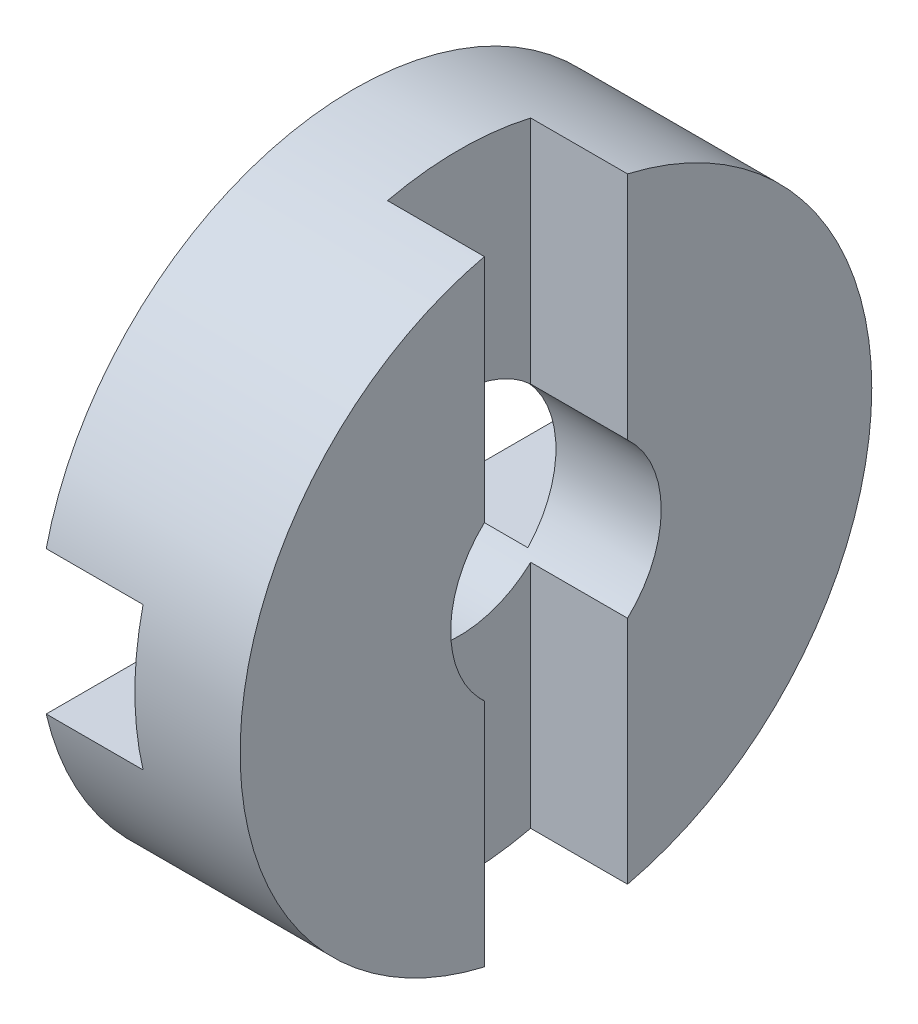
ISO-10303-21;
HEADER;
FILE_DESCRIPTION(('STEP AP214'),'2;1');
FILE_NAME('part.step','',(''),(''),'','','');
FILE_SCHEMA(('AUTOMOTIVE_DESIGN { 1 0 10303 214 1 1 1 1 }'));
ENDSEC;
DATA;
#1=APPLICATION_CONTEXT('core data for automotive mechanical design processes');
#2=APPLICATION_PROTOCOL_DEFINITION('international standard','automotive_design',2000,#1);
#3=PRODUCT_CONTEXT('',#1,'mechanical');
#4=PRODUCT('Part','Part','',(#3));
#5=PRODUCT_RELATED_PRODUCT_CATEGORY('part','',(#4));
#6=PRODUCT_DEFINITION_FORMATION('','',#4);
#7=PRODUCT_DEFINITION_CONTEXT('part definition',#1,'design');
#8=PRODUCT_DEFINITION('design','',#6,#7);
#9=PRODUCT_DEFINITION_SHAPE('','',#8);
#10=(LENGTH_UNIT() NAMED_UNIT(*) SI_UNIT(.MILLI.,.METRE.));
#11=(NAMED_UNIT(*) PLANE_ANGLE_UNIT() SI_UNIT($,.RADIAN.));
#12=(NAMED_UNIT(*) SI_UNIT($,.STERADIAN.) SOLID_ANGLE_UNIT());
#13=UNCERTAINTY_MEASURE_WITH_UNIT(LENGTH_MEASURE(1.E-05),#10,'distance_accuracy_value','');
#14=(GEOMETRIC_REPRESENTATION_CONTEXT(3) GLOBAL_UNCERTAINTY_ASSIGNED_CONTEXT((#13)) GLOBAL_UNIT_ASSIGNED_CONTEXT((#10,
#11,#12)) REPRESENTATION_CONTEXT('',''));
#15=CARTESIAN_POINT('',(0.,0.,0.));
#16=DIRECTION('',(0.,0.,1.));
#17=DIRECTION('',(1.,0.,0.));
#18=AXIS2_PLACEMENT_3D('',#15,#16,#17);
#19=CARTESIAN_POINT('',(-0.1,1.7,-7.5));
#20=DIRECTION('',(1.,0.,0.));
#21=DIRECTION('',(0.,0.,-1.));
#22=AXIS2_PLACEMENT_3D('',#19,#20,#21);
#23=PLANE('',#22);
#24=DIRECTION('',(0.,0.,1.));
#25=VECTOR('',#24,1.);
#26=CARTESIAN_POINT('',(-0.0999999999999998,1.7,-7.5));
#27=LINE('',#26,#25);
#28=CARTESIAN_POINT('',(-0.0999999999999999,1.7,-1.83303027798234));
#29=VERTEX_POINT('',#28);
#30=CARTESIAN_POINT('',(-0.1,1.7,-7.30479294709987));
#31=VERTEX_POINT('',#30);
#32=EDGE_CURVE('E141',#29,#31,#27,.F.);
#33=ORIENTED_EDGE('',*,*,#32,.T.);
#34=CARTESIAN_POINT('',(-0.1,0.,0.));
#35=DIRECTION('',(-1.,0.,0.));
#36=DIRECTION('',(0.,0.,1.));
#37=AXIS2_PLACEMENT_3D('',#34,#35,#36);
#38=CIRCLE('',#37,7.5);
#39=CARTESIAN_POINT('',(-0.1,-1.7,-7.30479294709987));
#40=VERTEX_POINT('',#39);
#41=EDGE_CURVE('E20',#40,#31,#38,.F.);
#42=ORIENTED_EDGE('',*,*,#41,.F.);
#43=DIRECTION('',(0.,0.,-1.));
#44=VECTOR('',#43,1.);
#45=CARTESIAN_POINT('',(-0.1,-1.7,-7.5));
#46=LINE('',#45,#44);
#47=CARTESIAN_POINT('',(-0.1,-1.7,-1.83303027798234));
#48=VERTEX_POINT('',#47);
#49=EDGE_CURVE('E205',#40,#48,#46,.F.);
#50=ORIENTED_EDGE('',*,*,#49,.T.);
#51=CARTESIAN_POINT('',(-0.1,0.,0.));
#52=DIRECTION('',(-1.,0.,0.));
#53=DIRECTION('',(0.,0.,1.));
#54=AXIS2_PLACEMENT_3D('',#51,#52,#53);
#55=CIRCLE('',#54,2.5);
#56=EDGE_CURVE('E143',#48,#29,#55,.F.);
#57=ORIENTED_EDGE('',*,*,#56,.T.);
#58=EDGE_LOOP('',(#33,#42,#50,#57));
#59=FACE_BOUND('',#58,.T.);
#60=ADVANCED_FACE('F17',(#59),#23,.F.);
#61=CARTESIAN_POINT('',(-0.1,1.7,-7.5));
#62=DIRECTION('',(1.,0.,0.));
#63=DIRECTION('',(0.,0.,-1.));
#64=AXIS2_PLACEMENT_3D('',#61,#62,#63);
#65=PLANE('',#64);
#66=DIRECTION('',(0.,0.,1.));
#67=VECTOR('',#66,1.);
#68=CARTESIAN_POINT('',(-0.0999999999999998,1.7,-7.5));
#69=LINE('',#68,#67);
#70=CARTESIAN_POINT('',(-0.0999999999999999,1.7,7.30479294709987));
#71=VERTEX_POINT('',#70);
#72=CARTESIAN_POINT('',(-0.0999999999999999,1.7,1.83303027798234));
#73=VERTEX_POINT('',#72);
#74=EDGE_CURVE('E212',#71,#73,#69,.F.);
#75=ORIENTED_EDGE('',*,*,#74,.T.);
#76=CARTESIAN_POINT('',(-0.1,0.,0.));
#77=DIRECTION('',(-1.,0.,0.));
#78=DIRECTION('',(0.,0.,1.));
#79=AXIS2_PLACEMENT_3D('',#76,#77,#78);
#80=CIRCLE('',#79,2.5);
#81=CARTESIAN_POINT('',(-0.1,-1.7,1.83303027798234));
#82=VERTEX_POINT('',#81);
#83=EDGE_CURVE('E188',#73,#82,#80,.F.);
#84=ORIENTED_EDGE('',*,*,#83,.T.);
#85=DIRECTION('',(0.,0.,-1.));
#86=VECTOR('',#85,1.);
#87=CARTESIAN_POINT('',(-0.1,-1.7,-7.5));
#88=LINE('',#87,#86);
#89=CARTESIAN_POINT('',(-0.1,-1.7,7.30479294709987));
#90=VERTEX_POINT('',#89);
#91=EDGE_CURVE('E198',#82,#90,#88,.F.);
#92=ORIENTED_EDGE('',*,*,#91,.T.);
#93=CARTESIAN_POINT('',(-0.1,0.,0.));
#94=DIRECTION('',(-1.,0.,0.));
#95=DIRECTION('',(0.,0.,1.));
#96=AXIS2_PLACEMENT_3D('',#93,#94,#95);
#97=CIRCLE('',#96,7.5);
#98=EDGE_CURVE('E139',#71,#90,#97,.F.);
#99=ORIENTED_EDGE('',*,*,#98,.F.);
#100=EDGE_LOOP('',(#75,#84,#92,#99));
#101=FACE_BOUND('',#100,.T.);
#102=ADVANCED_FACE('F250',(#101),#65,.F.);
#103=CARTESIAN_POINT('',(0.1,-7.5,1.7));
#104=DIRECTION('',(-1.,0.,0.));
#105=DIRECTION('',(0.,0.,1.));
#106=AXIS2_PLACEMENT_3D('',#103,#104,#105);
#107=PLANE('',#106);
#108=DIRECTION('',(0.,1.,0.));
#109=VECTOR('',#108,1.);
#110=CARTESIAN_POINT('',(0.0999999999999998,-7.5,1.7));
#111=LINE('',#110,#109);
#112=CARTESIAN_POINT('',(0.1,-1.83303027798234,1.7));
#113=VERTEX_POINT('',#112);
#114=CARTESIAN_POINT('',(0.1,-7.30479294709987,1.7));
#115=VERTEX_POINT('',#114);
#116=EDGE_CURVE('E208',#113,#115,#111,.F.);
#117=ORIENTED_EDGE('',*,*,#116,.T.);
#118=CARTESIAN_POINT('',(0.1,0.,0.));
#119=DIRECTION('',(-1.,0.,0.));
#120=DIRECTION('',(0.,0.,1.));
#121=AXIS2_PLACEMENT_3D('',#118,#119,#120);
#122=CIRCLE('',#121,7.5);
#123=CARTESIAN_POINT('',(0.1,-7.30479294709987,-1.7));
#124=VERTEX_POINT('',#123);
#125=EDGE_CURVE('E173',#124,#115,#122,.T.);
#126=ORIENTED_EDGE('',*,*,#125,.F.);
#127=DIRECTION('',(0.,1.,0.));
#128=VECTOR('',#127,1.);
#129=CARTESIAN_POINT('',(0.1,-7.5,-1.7));
#130=LINE('',#129,#128);
#131=CARTESIAN_POINT('',(0.1,-1.83303027798234,-1.7));
#132=VERTEX_POINT('',#131);
#133=EDGE_CURVE('E175',#124,#132,#130,.T.);
#134=ORIENTED_EDGE('',*,*,#133,.T.);
#135=CARTESIAN_POINT('',(0.1,0.,0.));
#136=DIRECTION('',(-1.,0.,0.));
#137=DIRECTION('',(0.,0.,1.));
#138=AXIS2_PLACEMENT_3D('',#135,#136,#137);
#139=CIRCLE('',#138,2.5);
#140=EDGE_CURVE('E189',#132,#113,#139,.T.);
#141=ORIENTED_EDGE('',*,*,#140,.T.);
#142=EDGE_LOOP('',(#117,#126,#134,#141));
#143=FACE_BOUND('',#142,.T.);
#144=ADVANCED_FACE('F332',(#143),#107,.F.);
#145=CARTESIAN_POINT('',(-0.1,-1.7,-7.5));
#146=DIRECTION('',(0.,-1.,0.));
#147=DIRECTION('',(0.,0.,-1.));
#148=AXIS2_PLACEMENT_3D('',#145,#146,#147);
#149=PLANE('',#148);
#150=ORIENTED_EDGE('',*,*,#91,.F.);
#151=DIRECTION('',(-1.,0.,0.));
#152=VECTOR('',#151,1.);
#153=CARTESIAN_POINT('',(0.,-1.7,1.83303027798234));
#154=LINE('',#153,#152);
#155=CARTESIAN_POINT('',(-2.4,-1.7,1.83303027798234));
#156=VERTEX_POINT('',#155);
#157=EDGE_CURVE('E222',#82,#156,#154,.T.);
#158=ORIENTED_EDGE('',*,*,#157,.T.);
#159=DIRECTION('',(0.,0.,1.));
#160=VECTOR('',#159,1.);
#161=CARTESIAN_POINT('',(-2.4,-1.7,-5.));
#162=LINE('',#161,#160);
#163=CARTESIAN_POINT('',(-2.4,-1.7,7.30479294709987));
#164=VERTEX_POINT('',#163);
#165=EDGE_CURVE('E194',#164,#156,#162,.F.);
#166=ORIENTED_EDGE('',*,*,#165,.F.);
#167=DIRECTION('',(-1.,0.,0.));
#168=VECTOR('',#167,1.);
#169=CARTESIAN_POINT('',(0.,-1.7,7.30479294709987));
#170=LINE('',#169,#168);
#171=EDGE_CURVE('E193',#90,#164,#170,.T.);
#172=ORIENTED_EDGE('',*,*,#171,.F.);
#173=EDGE_LOOP('',(#150,#158,#166,#172));
#174=FACE_BOUND('',#173,.T.);
#175=ADVANCED_FACE('F253',(#174),#149,.F.);
#176=CARTESIAN_POINT('',(-2.4,0.,-5.));
#177=DIRECTION('',(-1.,0.,0.));
#178=DIRECTION('',(0.,0.,1.));
#179=AXIS2_PLACEMENT_3D('',#176,#177,#178);
#180=PLANE('',#179);
#181=DIRECTION('',(0.,0.,-1.));
#182=VECTOR('',#181,1.);
#183=CARTESIAN_POINT('',(-2.4,-1.7,-7.5));
#184=LINE('',#183,#182);
#185=CARTESIAN_POINT('',(-2.4,-1.7,-1.83303027798234));
#186=VERTEX_POINT('',#185);
#187=CARTESIAN_POINT('',(-2.4,-1.7,-7.30479294709987));
#188=VERTEX_POINT('',#187);
#189=EDGE_CURVE('E197',#186,#188,#184,.T.);
#190=ORIENTED_EDGE('',*,*,#189,.T.);
#191=CARTESIAN_POINT('',(-2.4,0.,0.));
#192=DIRECTION('',(-1.,0.,0.));
#193=DIRECTION('',(0.,0.,1.));
#194=AXIS2_PLACEMENT_3D('',#191,#192,#193);
#195=CIRCLE('',#194,7.5);
#196=EDGE_CURVE('E201',#164,#188,#195,.F.);
#197=ORIENTED_EDGE('',*,*,#196,.F.);
#198=ORIENTED_EDGE('',*,*,#165,.T.);
#199=CARTESIAN_POINT('',(-2.4,0.,0.));
#200=DIRECTION('',(-1.,0.,0.));
#201=DIRECTION('',(0.,0.,1.));
#202=AXIS2_PLACEMENT_3D('',#199,#200,#201);
#203=CIRCLE('',#202,2.5);
#204=EDGE_CURVE('E220',#156,#186,#203,.F.);
#205=ORIENTED_EDGE('',*,*,#204,.T.);
#206=EDGE_LOOP('',(#190,#197,#198,#205));
#207=FACE_BOUND('',#206,.T.);
#208=ADVANCED_FACE('F257',(#207),#180,.T.);
#209=CARTESIAN_POINT('',(-0.1,-1.7,-7.5));
#210=DIRECTION('',(0.,-1.,0.));
#211=DIRECTION('',(0.,0.,-1.));
#212=AXIS2_PLACEMENT_3D('',#209,#210,#211);
#213=PLANE('',#212);
#214=ORIENTED_EDGE('',*,*,#49,.F.);
#215=DIRECTION('',(-1.,0.,0.));
#216=VECTOR('',#215,1.);
#217=CARTESIAN_POINT('',(0.,-1.7,-7.30479294709987));
#218=LINE('',#217,#216);
#219=EDGE_CURVE('E136',#188,#40,#218,.F.);
#220=ORIENTED_EDGE('',*,*,#219,.F.);
#221=ORIENTED_EDGE('',*,*,#189,.F.);
#222=DIRECTION('',(-1.,0.,0.));
#223=VECTOR('',#222,1.);
#224=CARTESIAN_POINT('',(0.,-1.7,-1.83303027798234));
#225=LINE('',#224,#223);
#226=EDGE_CURVE('E217',#186,#48,#225,.F.);
#227=ORIENTED_EDGE('',*,*,#226,.T.);
#228=EDGE_LOOP('',(#214,#220,#221,#227));
#229=FACE_BOUND('',#228,.T.);
#230=ADVANCED_FACE('F261',(#229),#213,.F.);
#231=CARTESIAN_POINT('',(2.4,-7.5,1.7));
#232=DIRECTION('',(0.,0.,1.));
#233=DIRECTION('',(1.,0.,0.));
#234=AXIS2_PLACEMENT_3D('',#231,#232,#233);
#235=PLANE('',#234);
#236=DIRECTION('',(0.,1.,0.));
#237=VECTOR('',#236,1.);
#238=CARTESIAN_POINT('',(2.4,0.,1.7));
#239=LINE('',#238,#237);
#240=CARTESIAN_POINT('',(2.4,-7.30479294709987,1.7));
#241=VERTEX_POINT('',#240);
#242=CARTESIAN_POINT('',(2.4,-1.83303027798234,1.7));
#243=VERTEX_POINT('',#242);
#244=EDGE_CURVE('E203',#241,#243,#239,.T.);
#245=ORIENTED_EDGE('',*,*,#244,.F.);
#246=DIRECTION('',(-1.,0.,0.));
#247=VECTOR('',#246,1.);
#248=CARTESIAN_POINT('',(0.,-7.30479294709987,1.7));
#249=LINE('',#248,#247);
#250=EDGE_CURVE('E190',#115,#241,#249,.F.);
#251=ORIENTED_EDGE('',*,*,#250,.F.);
#252=ORIENTED_EDGE('',*,*,#116,.F.);
#253=DIRECTION('',(-1.,0.,0.));
#254=VECTOR('',#253,1.);
#255=CARTESIAN_POINT('',(0.,-1.83303027798234,1.7));
#256=LINE('',#255,#254);
#257=EDGE_CURVE('E185',#113,#243,#256,.F.);
#258=ORIENTED_EDGE('',*,*,#257,.T.);
#259=EDGE_LOOP('',(#245,#251,#252,#258));
#260=FACE_BOUND('',#259,.T.);
#261=ADVANCED_FACE('F319',(#260),#235,.F.);
#262=CARTESIAN_POINT('',(0.,0.,0.));
#263=DIRECTION('',(-1.,0.,0.));
#264=DIRECTION('',(0.,0.,1.));
#265=AXIS2_PLACEMENT_3D('',#262,#263,#264);
#266=CYLINDRICAL_SURFACE('',#265,2.5);
#267=ORIENTED_EDGE('',*,*,#83,.F.);
#268=DIRECTION('',(1.,0.,0.));
#269=VECTOR('',#268,1.);
#270=CARTESIAN_POINT('',(-2.4,1.7,1.83303027798234));
#271=LINE('',#270,#269);
#272=CARTESIAN_POINT('',(-2.4,1.7,1.83303027798234));
#273=VERTEX_POINT('',#272);
#274=EDGE_CURVE('E169',#73,#273,#271,.F.);
#275=ORIENTED_EDGE('',*,*,#274,.T.);
#276=CARTESIAN_POINT('',(-2.4,0.,0.));
#277=DIRECTION('',(-1.,0.,0.));
#278=DIRECTION('',(0.,0.,1.));
#279=AXIS2_PLACEMENT_3D('',#276,#277,#278);
#280=CIRCLE('',#279,2.5);
#281=CARTESIAN_POINT('',(-2.4,1.7,-1.83303027798234));
#282=VERTEX_POINT('',#281);
#283=EDGE_CURVE('E215',#282,#273,#280,.F.);
#284=ORIENTED_EDGE('',*,*,#283,.F.);
#285=DIRECTION('',(1.,0.,0.));
#286=VECTOR('',#285,1.);
#287=CARTESIAN_POINT('',(-2.4,1.7,-1.83303027798234));
#288=LINE('',#287,#286);
#289=EDGE_CURVE('E146',#282,#29,#288,.T.);
#290=ORIENTED_EDGE('',*,*,#289,.T.);
#291=ORIENTED_EDGE('',*,*,#56,.F.);
#292=ORIENTED_EDGE('',*,*,#226,.F.);
#293=ORIENTED_EDGE('',*,*,#204,.F.);
#294=ORIENTED_EDGE('',*,*,#157,.F.);
#295=EDGE_LOOP('',(#267,#275,#284,#290,#291,#292,#293,#294));
#296=FACE_BOUND('',#295,.T.);
#297=CARTESIAN_POINT('',(2.4,0.,0.));
#298=DIRECTION('',(-1.,0.,0.));
#299=DIRECTION('',(0.,0.,1.));
#300=AXIS2_PLACEMENT_3D('',#297,#298,#299);
#301=CIRCLE('',#300,2.5);
#302=CARTESIAN_POINT('',(2.4,1.83303027798234,1.7));
#303=VERTEX_POINT('',#302);
#304=EDGE_CURVE('E235',#243,#303,#301,.T.);
#305=ORIENTED_EDGE('',*,*,#304,.F.);
#306=ORIENTED_EDGE('',*,*,#257,.F.);
#307=ORIENTED_EDGE('',*,*,#140,.F.);
#308=DIRECTION('',(-1.,0.,0.));
#309=VECTOR('',#308,1.);
#310=CARTESIAN_POINT('',(0.1,-1.83303027798234,-1.7));
#311=LINE('',#310,#309);
#312=CARTESIAN_POINT('',(2.4,-1.83303027798234,-1.7));
#313=VERTEX_POINT('',#312);
#314=EDGE_CURVE('E147',#132,#313,#311,.F.);
#315=ORIENTED_EDGE('',*,*,#314,.T.);
#316=CARTESIAN_POINT('',(2.4,0.,0.));
#317=DIRECTION('',(-1.,0.,0.));
#318=DIRECTION('',(0.,0.,1.));
#319=AXIS2_PLACEMENT_3D('',#316,#317,#318);
#320=CIRCLE('',#319,2.5);
#321=CARTESIAN_POINT('',(2.4,1.83303027798234,-1.7));
#322=VERTEX_POINT('',#321);
#323=EDGE_CURVE('E159',#322,#313,#320,.T.);
#324=ORIENTED_EDGE('',*,*,#323,.F.);
#325=DIRECTION('',(-1.,0.,0.));
#326=VECTOR('',#325,1.);
#327=CARTESIAN_POINT('',(0.1,1.83303027798234,-1.7));
#328=LINE('',#327,#326);
#329=CARTESIAN_POINT('',(0.1,1.83303027798234,-1.7));
#330=VERTEX_POINT('',#329);
#331=EDGE_CURVE('E176',#322,#330,#328,.T.);
#332=ORIENTED_EDGE('',*,*,#331,.T.);
#333=CARTESIAN_POINT('',(0.1,0.,0.));
#334=DIRECTION('',(-1.,0.,0.));
#335=DIRECTION('',(0.,0.,1.));
#336=AXIS2_PLACEMENT_3D('',#333,#334,#335);
#337=CIRCLE('',#336,2.5);
#338=CARTESIAN_POINT('',(0.1,1.83303027798234,1.7));
#339=VERTEX_POINT('',#338);
#340=EDGE_CURVE('E232',#330,#339,#337,.F.);
#341=ORIENTED_EDGE('',*,*,#340,.T.);
#342=DIRECTION('',(1.,0.,0.));
#343=VECTOR('',#342,1.);
#344=CARTESIAN_POINT('',(2.4,1.83303027798234,1.7));
#345=LINE('',#344,#343);
#346=EDGE_CURVE('E180',#339,#303,#345,.T.);
#347=ORIENTED_EDGE('',*,*,#346,.T.);
#348=EDGE_LOOP('',(#305,#306,#307,#315,#324,#332,#341,#347));
#349=FACE_BOUND('',#348,.T.);
#350=ADVANCED_FACE('F263',(#296,#349),#266,.F.);
#351=CARTESIAN_POINT('',(0.1,-7.5,-1.7));
#352=DIRECTION('',(0.,0.,-1.));
#353=DIRECTION('',(-1.,0.,0.));
#354=AXIS2_PLACEMENT_3D('',#351,#352,#353);
#355=PLANE('',#354);
#356=ORIENTED_EDGE('',*,*,#133,.F.);
#357=DIRECTION('',(-1.,0.,0.));
#358=VECTOR('',#357,1.);
#359=CARTESIAN_POINT('',(0.,-7.30479294709987,-1.70000000000001));
#360=LINE('',#359,#358);
#361=CARTESIAN_POINT('',(2.4,-7.30479294709987,-1.7));
#362=VERTEX_POINT('',#361);
#363=EDGE_CURVE('E168',#362,#124,#360,.T.);
#364=ORIENTED_EDGE('',*,*,#363,.F.);
#365=DIRECTION('',(0.,1.,0.));
#366=VECTOR('',#365,1.);
#367=CARTESIAN_POINT('',(2.4,0.,-1.7));
#368=LINE('',#367,#366);
#369=EDGE_CURVE('E154',#313,#362,#368,.F.);
#370=ORIENTED_EDGE('',*,*,#369,.F.);
#371=ORIENTED_EDGE('',*,*,#314,.F.);
#372=EDGE_LOOP('',(#356,#364,#370,#371));
#373=FACE_BOUND('',#372,.T.);
#374=ADVANCED_FACE('F329',(#373),#355,.F.);
#375=CARTESIAN_POINT('',(-2.4,1.7,-7.5));
#376=DIRECTION('',(0.,1.,0.));
#377=DIRECTION('',(0.,0.,1.));
#378=AXIS2_PLACEMENT_3D('',#375,#376,#377);
#379=PLANE('',#378);
#380=DIRECTION('',(0.,0.,1.));
#381=VECTOR('',#380,1.);
#382=CARTESIAN_POINT('',(-2.4,1.7,-5.));
#383=LINE('',#382,#381);
#384=CARTESIAN_POINT('',(-2.4,1.7,-7.30479294709987));
#385=VERTEX_POINT('',#384);
#386=EDGE_CURVE('E151',#385,#282,#383,.T.);
#387=ORIENTED_EDGE('',*,*,#386,.F.);
#388=DIRECTION('',(-1.,0.,0.));
#389=VECTOR('',#388,1.);
#390=CARTESIAN_POINT('',(0.,1.7,-7.30479294709987));
#391=LINE('',#390,#389);
#392=EDGE_CURVE('E133',#31,#385,#391,.T.);
#393=ORIENTED_EDGE('',*,*,#392,.F.);
#394=ORIENTED_EDGE('',*,*,#32,.F.);
#395=ORIENTED_EDGE('',*,*,#289,.F.);
#396=EDGE_LOOP('',(#387,#393,#394,#395));
#397=FACE_BOUND('',#396,.T.);
#398=ADVANCED_FACE('F149',(#397),#379,.F.);
#399=CARTESIAN_POINT('',(-2.4,0.,-5.));
#400=DIRECTION('',(-1.,0.,0.));
#401=DIRECTION('',(0.,0.,1.));
#402=AXIS2_PLACEMENT_3D('',#399,#400,#401);
#403=PLANE('',#402);
#404=ORIENTED_EDGE('',*,*,#386,.T.);
#405=ORIENTED_EDGE('',*,*,#283,.T.);
#406=DIRECTION('',(0.,0.,1.));
#407=VECTOR('',#406,1.);
#408=CARTESIAN_POINT('',(-2.4,1.7,-7.5));
#409=LINE('',#408,#407);
#410=CARTESIAN_POINT('',(-2.4,1.7,7.30479294709987));
#411=VERTEX_POINT('',#410);
#412=EDGE_CURVE('E167',#273,#411,#409,.T.);
#413=ORIENTED_EDGE('',*,*,#412,.T.);
#414=CARTESIAN_POINT('',(-2.4,0.,0.));
#415=DIRECTION('',(-1.,0.,0.));
#416=DIRECTION('',(0.,0.,1.));
#417=AXIS2_PLACEMENT_3D('',#414,#415,#416);
#418=CIRCLE('',#417,7.5);
#419=EDGE_CURVE('E153',#385,#411,#418,.F.);
#420=ORIENTED_EDGE('',*,*,#419,.F.);
#421=EDGE_LOOP('',(#404,#405,#413,#420));
#422=FACE_BOUND('',#421,.T.);
#423=ADVANCED_FACE('F269',(#422),#403,.T.);
#424=CARTESIAN_POINT('',(-2.4,1.7,-7.5));
#425=DIRECTION('',(0.,1.,0.));
#426=DIRECTION('',(0.,0.,1.));
#427=AXIS2_PLACEMENT_3D('',#424,#425,#426);
#428=PLANE('',#427);
#429=ORIENTED_EDGE('',*,*,#412,.F.);
#430=ORIENTED_EDGE('',*,*,#274,.F.);
#431=ORIENTED_EDGE('',*,*,#74,.F.);
#432=DIRECTION('',(-1.,0.,0.));
#433=VECTOR('',#432,1.);
#434=CARTESIAN_POINT('',(0.,1.7,7.30479294709987));
#435=LINE('',#434,#433);
#436=EDGE_CURVE('E156',#411,#71,#435,.F.);
#437=ORIENTED_EDGE('',*,*,#436,.F.);
#438=EDGE_LOOP('',(#429,#430,#431,#437));
#439=FACE_BOUND('',#438,.T.);
#440=ADVANCED_FACE('F271',(#439),#428,.F.);
#441=CARTESIAN_POINT('',(2.4,0.,-5.));
#442=DIRECTION('',(1.,0.,0.));
#443=DIRECTION('',(0.,0.,-1.));
#444=AXIS2_PLACEMENT_3D('',#441,#442,#443);
#445=PLANE('',#444);
#446=ORIENTED_EDGE('',*,*,#244,.T.);
#447=ORIENTED_EDGE('',*,*,#304,.T.);
#448=DIRECTION('',(0.,1.,0.));
#449=VECTOR('',#448,1.);
#450=CARTESIAN_POINT('',(2.4,-7.5,1.7));
#451=LINE('',#450,#449);
#452=CARTESIAN_POINT('',(2.4,7.30479294709987,1.7));
#453=VERTEX_POINT('',#452);
#454=EDGE_CURVE('E184',#303,#453,#451,.T.);
#455=ORIENTED_EDGE('',*,*,#454,.T.);
#456=CARTESIAN_POINT('',(2.4,0.,0.));
#457=DIRECTION('',(-1.,0.,0.));
#458=DIRECTION('',(0.,0.,1.));
#459=AXIS2_PLACEMENT_3D('',#456,#457,#458);
#460=CIRCLE('',#459,7.5);
#461=EDGE_CURVE('E166',#241,#453,#460,.T.);
#462=ORIENTED_EDGE('',*,*,#461,.F.);
#463=EDGE_LOOP('',(#446,#447,#455,#462));
#464=FACE_BOUND('',#463,.T.);
#465=ADVANCED_FACE('F273',(#464),#445,.T.);
#466=CARTESIAN_POINT('',(2.4,-7.5,1.7));
#467=DIRECTION('',(0.,0.,1.));
#468=DIRECTION('',(1.,0.,0.));
#469=AXIS2_PLACEMENT_3D('',#466,#467,#468);
#470=PLANE('',#469);
#471=DIRECTION('',(0.,1.,0.));
#472=VECTOR('',#471,1.);
#473=CARTESIAN_POINT('',(0.1,-7.5,1.7));
#474=LINE('',#473,#472);
#475=CARTESIAN_POINT('',(0.1,7.30479294709987,1.7));
#476=VERTEX_POINT('',#475);
#477=EDGE_CURVE('E183',#339,#476,#474,.T.);
#478=ORIENTED_EDGE('',*,*,#477,.T.);
#479=DIRECTION('',(-1.,0.,0.));
#480=VECTOR('',#479,1.);
#481=CARTESIAN_POINT('',(0.,7.30479294709987,1.7));
#482=LINE('',#481,#480);
#483=EDGE_CURVE('E227',#453,#476,#482,.T.);
#484=ORIENTED_EDGE('',*,*,#483,.F.);
#485=ORIENTED_EDGE('',*,*,#454,.F.);
#486=ORIENTED_EDGE('',*,*,#346,.F.);
#487=EDGE_LOOP('',(#478,#484,#485,#486));
#488=FACE_BOUND('',#487,.T.);
#489=ADVANCED_FACE('F280',(#488),#470,.F.);
#490=CARTESIAN_POINT('',(0.1,-7.5,1.7));
#491=DIRECTION('',(-1.,0.,0.));
#492=DIRECTION('',(0.,0.,1.));
#493=AXIS2_PLACEMENT_3D('',#490,#491,#492);
#494=PLANE('',#493);
#495=DIRECTION('',(0.,1.,0.));
#496=VECTOR('',#495,1.);
#497=CARTESIAN_POINT('',(0.1,-7.5,-1.7));
#498=LINE('',#497,#496);
#499=CARTESIAN_POINT('',(0.1,7.30479294709987,-1.7));
#500=VERTEX_POINT('',#499);
#501=EDGE_CURVE('E179',#330,#500,#498,.T.);
#502=ORIENTED_EDGE('',*,*,#501,.T.);
#503=CARTESIAN_POINT('',(0.1,0.,0.));
#504=DIRECTION('',(-1.,0.,0.));
#505=DIRECTION('',(0.,0.,1.));
#506=AXIS2_PLACEMENT_3D('',#503,#504,#505);
#507=CIRCLE('',#506,7.5);
#508=EDGE_CURVE('E224',#476,#500,#507,.T.);
#509=ORIENTED_EDGE('',*,*,#508,.F.);
#510=ORIENTED_EDGE('',*,*,#477,.F.);
#511=ORIENTED_EDGE('',*,*,#340,.F.);
#512=EDGE_LOOP('',(#502,#509,#510,#511));
#513=FACE_BOUND('',#512,.T.);
#514=ADVANCED_FACE('F296',(#513),#494,.F.);
#515=CARTESIAN_POINT('',(0.1,-7.5,-1.7));
#516=DIRECTION('',(0.,0.,-1.));
#517=DIRECTION('',(-1.,0.,0.));
#518=AXIS2_PLACEMENT_3D('',#515,#516,#517);
#519=PLANE('',#518);
#520=DIRECTION('',(0.,1.,0.));
#521=VECTOR('',#520,1.);
#522=CARTESIAN_POINT('',(2.4,0.,-1.7));
#523=LINE('',#522,#521);
#524=CARTESIAN_POINT('',(2.4,7.30479294709987,-1.7));
#525=VERTEX_POINT('',#524);
#526=EDGE_CURVE('E35',#525,#322,#523,.F.);
#527=ORIENTED_EDGE('',*,*,#526,.F.);
#528=DIRECTION('',(-1.,0.,0.));
#529=VECTOR('',#528,1.);
#530=CARTESIAN_POINT('',(0.,7.30479294709987,-1.7));
#531=LINE('',#530,#529);
#532=EDGE_CURVE('E26',#500,#525,#531,.F.);
#533=ORIENTED_EDGE('',*,*,#532,.F.);
#534=ORIENTED_EDGE('',*,*,#501,.F.);
#535=ORIENTED_EDGE('',*,*,#331,.F.);
#536=EDGE_LOOP('',(#527,#533,#534,#535));
#537=FACE_BOUND('',#536,.T.);
#538=ADVANCED_FACE('F290',(#537),#519,.F.);
#539=CARTESIAN_POINT('',(2.4,0.,-5.));
#540=DIRECTION('',(1.,0.,0.));
#541=DIRECTION('',(0.,0.,-1.));
#542=AXIS2_PLACEMENT_3D('',#539,#540,#541);
#543=PLANE('',#542);
#544=ORIENTED_EDGE('',*,*,#369,.T.);
#545=CARTESIAN_POINT('',(2.4,0.,0.));
#546=DIRECTION('',(-1.,0.,0.));
#547=DIRECTION('',(0.,0.,1.));
#548=AXIS2_PLACEMENT_3D('',#545,#546,#547);
#549=CIRCLE('',#548,7.5);
#550=EDGE_CURVE('E11',#525,#362,#549,.T.);
#551=ORIENTED_EDGE('',*,*,#550,.F.);
#552=ORIENTED_EDGE('',*,*,#526,.T.);
#553=ORIENTED_EDGE('',*,*,#323,.T.);
#554=EDGE_LOOP('',(#544,#551,#552,#553));
#555=FACE_BOUND('',#554,.T.);
#556=ADVANCED_FACE('F285',(#555),#543,.T.);
#557=CARTESIAN_POINT('',(0.,0.,0.));
#558=DIRECTION('',(-1.,0.,0.));
#559=DIRECTION('',(0.,0.,1.));
#560=AXIS2_PLACEMENT_3D('',#557,#558,#559);
#561=CYLINDRICAL_SURFACE('',#560,7.5);
#562=ORIENTED_EDGE('',*,*,#219,.T.);
#563=ORIENTED_EDGE('',*,*,#41,.T.);
#564=ORIENTED_EDGE('',*,*,#392,.T.);
#565=ORIENTED_EDGE('',*,*,#419,.T.);
#566=ORIENTED_EDGE('',*,*,#436,.T.);
#567=ORIENTED_EDGE('',*,*,#98,.T.);
#568=ORIENTED_EDGE('',*,*,#171,.T.);
#569=ORIENTED_EDGE('',*,*,#196,.T.);
#570=EDGE_LOOP('',(#562,#563,#564,#565,#566,#567,#568,#569));
#571=FACE_BOUND('',#570,.T.);
#572=ORIENTED_EDGE('',*,*,#532,.T.);
#573=ORIENTED_EDGE('',*,*,#550,.T.);
#574=ORIENTED_EDGE('',*,*,#363,.T.);
#575=ORIENTED_EDGE('',*,*,#125,.T.);
#576=ORIENTED_EDGE('',*,*,#250,.T.);
#577=ORIENTED_EDGE('',*,*,#461,.T.);
#578=ORIENTED_EDGE('',*,*,#483,.T.);
#579=ORIENTED_EDGE('',*,*,#508,.T.);
#580=EDGE_LOOP('',(#572,#573,#574,#575,#576,#577,#578,#579));
#581=FACE_BOUND('',#580,.T.);
#582=ADVANCED_FACE('F129',(#571,#581),#561,.T.);
#583=CLOSED_SHELL('',(#60,#102,#144,#175,#208,#230,#261,#350,#374,#398,#423,#440,#465,#489,#514,
#538,#556,#582));
#584=MANIFOLD_SOLID_BREP('B1',#583);
#585=ADVANCED_BREP_SHAPE_REPRESENTATION('',(#18,#584),#14);
#586=SHAPE_DEFINITION_REPRESENTATION(#9,#585);
ENDSEC;
END-ISO-10303-21;
